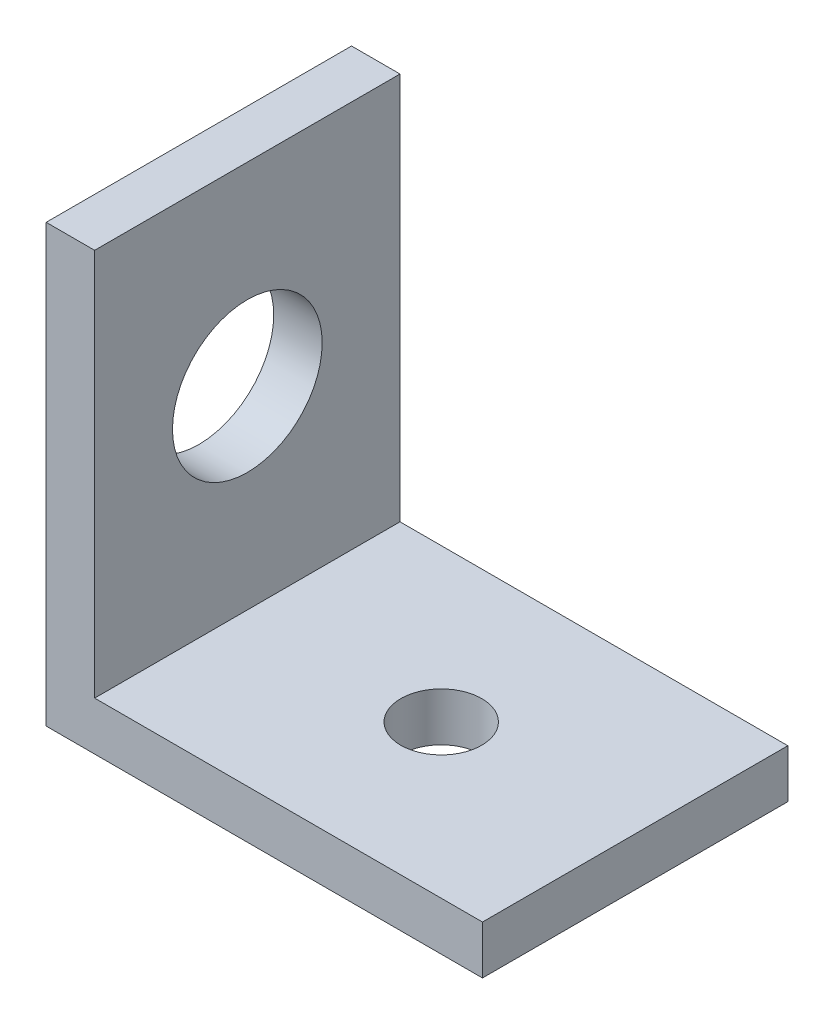
ISO-10303-21;
HEADER;
FILE_DESCRIPTION(('STEP AP214'),'2;1');
FILE_NAME('part.step','',(''),(''),'','','');
FILE_SCHEMA(('AUTOMOTIVE_DESIGN { 1 0 10303 214 1 1 1 1 }'));
ENDSEC;
DATA;
#1=APPLICATION_CONTEXT('core data for automotive mechanical design processes');
#2=APPLICATION_PROTOCOL_DEFINITION('international standard','automotive_design',2000,#1);
#3=PRODUCT_CONTEXT('',#1,'mechanical');
#4=PRODUCT('Part','Part','',(#3));
#5=PRODUCT_RELATED_PRODUCT_CATEGORY('part','',(#4));
#6=PRODUCT_DEFINITION_FORMATION('','',#4);
#7=PRODUCT_DEFINITION_CONTEXT('part definition',#1,'design');
#8=PRODUCT_DEFINITION('design','',#6,#7);
#9=PRODUCT_DEFINITION_SHAPE('','',#8);
#10=(LENGTH_UNIT() NAMED_UNIT(*) SI_UNIT(.MILLI.,.METRE.));
#11=(NAMED_UNIT(*) PLANE_ANGLE_UNIT() SI_UNIT($,.RADIAN.));
#12=(NAMED_UNIT(*) SI_UNIT($,.STERADIAN.) SOLID_ANGLE_UNIT());
#13=UNCERTAINTY_MEASURE_WITH_UNIT(LENGTH_MEASURE(1.E-05),#10,'distance_accuracy_value','');
#14=(GEOMETRIC_REPRESENTATION_CONTEXT(3) GLOBAL_UNCERTAINTY_ASSIGNED_CONTEXT((#13)) GLOBAL_UNIT_ASSIGNED_CONTEXT((#10,
#11,#12)) REPRESENTATION_CONTEXT('',''));
#15=CARTESIAN_POINT('',(0.,0.,0.));
#16=DIRECTION('',(0.,0.,1.));
#17=DIRECTION('',(1.,0.,0.));
#18=AXIS2_PLACEMENT_3D('',#15,#16,#17);
#19=CARTESIAN_POINT('',(-3.175,12.7,10.));
#20=DIRECTION('',(-1.,0.,0.));
#21=DIRECTION('',(0.,0.,1.));
#22=AXIS2_PLACEMENT_3D('',#19,#20,#21);
#23=CYLINDRICAL_SURFACE('',#22,4.9022);
#24=CARTESIAN_POINT('',(0.,12.7,10.));
#25=DIRECTION('',(-1.,0.,0.));
#26=DIRECTION('',(0.,-1.,0.));
#27=AXIS2_PLACEMENT_3D('',#24,#25,#26);
#28=CIRCLE('',#27,4.9022);
#29=CARTESIAN_POINT('',(0.,7.79780000000001,10.));
#30=VERTEX_POINT('',#29);
#31=EDGE_CURVE('E150',#30,#30,#28,.T.);
#32=ORIENTED_EDGE('',*,*,#31,.F.);
#33=EDGE_LOOP('',(#32));
#34=FACE_BOUND('',#33,.T.);
#35=CARTESIAN_POINT('',(-3.174,12.7,10.));
#36=DIRECTION('',(-1.,0.,0.));
#37=DIRECTION('',(0.,-1.,0.));
#38=AXIS2_PLACEMENT_3D('',#35,#36,#37);
#39=CIRCLE('',#38,4.9022);
#40=CARTESIAN_POINT('',(-3.174,7.79780000000001,10.));
#41=VERTEX_POINT('',#40);
#42=EDGE_CURVE('E50',#41,#41,#39,.F.);
#43=ORIENTED_EDGE('',*,*,#42,.F.);
#44=EDGE_LOOP('',(#43));
#45=FACE_BOUND('',#44,.T.);
#46=ADVANCED_FACE('F46',(#34,#45),#23,.F.);
#47=CARTESIAN_POINT('',(0.,2.54000000000002,20.));
#48=DIRECTION('',(-1.,0.,0.));
#49=DIRECTION('',(0.,-1.,0.));
#50=AXIS2_PLACEMENT_3D('',#47,#48,#49);
#51=PLANE('',#50);
#52=ORIENTED_EDGE('',*,*,#31,.T.);
#53=EDGE_LOOP('',(#52));
#54=FACE_BOUND('',#53,.T.);
#55=DIRECTION('',(0.,1.,0.));
#56=VECTOR('',#55,1.);
#57=CARTESIAN_POINT('',(0.,2.54000000000002,0.));
#58=LINE('',#57,#56);
#59=CARTESIAN_POINT('',(0.,0.,0.));
#60=VERTEX_POINT('',#59);
#61=CARTESIAN_POINT('',(0.,25.4,0.));
#62=VERTEX_POINT('',#61);
#63=EDGE_CURVE('E95',#60,#62,#58,.T.);
#64=ORIENTED_EDGE('',*,*,#63,.T.);
#65=DIRECTION('',(0.,0.,-1.));
#66=VECTOR('',#65,1.);
#67=CARTESIAN_POINT('',(0.,25.4,20.));
#68=LINE('',#67,#66);
#69=CARTESIAN_POINT('',(0.,25.4,20.));
#70=VERTEX_POINT('',#69);
#71=EDGE_CURVE('E12',#70,#62,#68,.T.);
#72=ORIENTED_EDGE('',*,*,#71,.F.);
#73=DIRECTION('',(0.,-1.,0.));
#74=VECTOR('',#73,1.);
#75=CARTESIAN_POINT('',(0.,2.54000000000002,20.));
#76=LINE('',#75,#74);
#77=CARTESIAN_POINT('',(0.,0.,20.));
#78=VERTEX_POINT('',#77);
#79=EDGE_CURVE('E66',#70,#78,#76,.T.);
#80=ORIENTED_EDGE('',*,*,#79,.T.);
#81=DIRECTION('',(0.,0.,-1.));
#82=VECTOR('',#81,1.);
#83=CARTESIAN_POINT('',(0.,0.,20.));
#84=LINE('',#83,#82);
#85=EDGE_CURVE('E101',#78,#60,#84,.T.);
#86=ORIENTED_EDGE('',*,*,#85,.T.);
#87=EDGE_LOOP('',(#64,#72,#80,#86));
#88=FACE_BOUND('',#87,.T.);
#89=ADVANCED_FACE('F170',(#54,#88),#51,.F.);
#90=CARTESIAN_POINT('',(0.,25.4,20.));
#91=DIRECTION('',(0.,-1.,0.));
#92=DIRECTION('',(0.,0.,-1.));
#93=AXIS2_PLACEMENT_3D('',#90,#91,#92);
#94=PLANE('',#93);
#95=DIRECTION('',(-1.,0.,0.));
#96=VECTOR('',#95,1.);
#97=CARTESIAN_POINT('',(0.,25.4,0.));
#98=LINE('',#97,#96);
#99=CARTESIAN_POINT('',(-3.175,25.4,0.));
#100=VERTEX_POINT('',#99);
#101=EDGE_CURVE('E88',#62,#100,#98,.T.);
#102=ORIENTED_EDGE('',*,*,#101,.T.);
#103=DIRECTION('',(0.,0.,-1.));
#104=VECTOR('',#103,1.);
#105=CARTESIAN_POINT('',(-3.175,25.4,20.));
#106=LINE('',#105,#104);
#107=CARTESIAN_POINT('',(-3.175,25.4,20.));
#108=VERTEX_POINT('',#107);
#109=EDGE_CURVE('E57',#108,#100,#106,.T.);
#110=ORIENTED_EDGE('',*,*,#109,.F.);
#111=DIRECTION('',(-1.,0.,0.));
#112=VECTOR('',#111,1.);
#113=CARTESIAN_POINT('',(0.,25.4,20.));
#114=LINE('',#113,#112);
#115=EDGE_CURVE('E116',#70,#108,#114,.T.);
#116=ORIENTED_EDGE('',*,*,#115,.F.);
#117=ORIENTED_EDGE('',*,*,#71,.T.);
#118=EDGE_LOOP('',(#102,#110,#116,#117));
#119=FACE_BOUND('',#118,.T.);
#120=ADVANCED_FACE('F207',(#119),#94,.F.);
#121=CARTESIAN_POINT('',(-3.175,25.4,20.));
#122=DIRECTION('',(1.,0.,0.));
#123=DIRECTION('',(0.,1.,0.));
#124=AXIS2_PLACEMENT_3D('',#121,#122,#123);
#125=PLANE('',#124);
#126=CARTESIAN_POINT('',(-3.175,12.7,10.));
#127=DIRECTION('',(-1.,0.,0.));
#128=DIRECTION('',(0.,-1.,0.));
#129=AXIS2_PLACEMENT_3D('',#126,#127,#128);
#130=CIRCLE('',#129,9.525);
#131=CARTESIAN_POINT('',(-3.175,3.175,10.));
#132=VERTEX_POINT('',#131);
#133=EDGE_CURVE('E186',#132,#132,#130,.T.);
#134=ORIENTED_EDGE('',*,*,#133,.F.);
#135=EDGE_LOOP('',(#134));
#136=FACE_BOUND('',#135,.T.);
#137=DIRECTION('',(0.,-1.,0.));
#138=VECTOR('',#137,1.);
#139=CARTESIAN_POINT('',(-3.175,25.4,0.));
#140=LINE('',#139,#138);
#141=CARTESIAN_POINT('',(-3.175,-3.175,0.));
#142=VERTEX_POINT('',#141);
#143=EDGE_CURVE('E124',#100,#142,#140,.T.);
#144=ORIENTED_EDGE('',*,*,#143,.T.);
#145=DIRECTION('',(0.,0.,-1.));
#146=VECTOR('',#145,1.);
#147=CARTESIAN_POINT('',(-3.175,-3.175,20.));
#148=LINE('',#147,#146);
#149=CARTESIAN_POINT('',(-3.175,-3.175,20.));
#150=VERTEX_POINT('',#149);
#151=EDGE_CURVE('E121',#150,#142,#148,.T.);
#152=ORIENTED_EDGE('',*,*,#151,.F.);
#153=DIRECTION('',(0.,-1.,0.));
#154=VECTOR('',#153,1.);
#155=CARTESIAN_POINT('',(-3.175,25.4,20.));
#156=LINE('',#155,#154);
#157=EDGE_CURVE('E108',#108,#150,#156,.T.);
#158=ORIENTED_EDGE('',*,*,#157,.F.);
#159=ORIENTED_EDGE('',*,*,#109,.T.);
#160=EDGE_LOOP('',(#144,#152,#158,#159));
#161=FACE_BOUND('',#160,.T.);
#162=ADVANCED_FACE('F122',(#136,#161),#125,.F.);
#163=CARTESIAN_POINT('',(-3.175,-3.175,20.));
#164=DIRECTION('',(0.,1.,0.));
#165=DIRECTION('',(-1.,0.,0.));
#166=AXIS2_PLACEMENT_3D('',#163,#164,#165);
#167=PLANE('',#166);
#168=CARTESIAN_POINT('',(12.7,-3.175,10.));
#169=DIRECTION('',(0.,1.,0.));
#170=DIRECTION('',(0.,0.,1.));
#171=AXIS2_PLACEMENT_3D('',#168,#169,#170);
#172=CIRCLE('',#171,2.65);
#173=CARTESIAN_POINT('',(12.7,-3.175,12.65));
#174=VERTEX_POINT('',#173);
#175=EDGE_CURVE('E178',#174,#174,#172,.T.);
#176=ORIENTED_EDGE('',*,*,#175,.T.);
#177=EDGE_LOOP('',(#176));
#178=FACE_BOUND('',#177,.T.);
#179=DIRECTION('',(1.,0.,0.));
#180=VECTOR('',#179,1.);
#181=CARTESIAN_POINT('',(-3.175,-3.175,0.));
#182=LINE('',#181,#180);
#183=CARTESIAN_POINT('',(25.4,-3.175,0.));
#184=VERTEX_POINT('',#183);
#185=EDGE_CURVE('E153',#142,#184,#182,.T.);
#186=ORIENTED_EDGE('',*,*,#185,.T.);
#187=DIRECTION('',(0.,0.,-1.));
#188=VECTOR('',#187,1.);
#189=CARTESIAN_POINT('',(25.4,-3.175,20.));
#190=LINE('',#189,#188);
#191=CARTESIAN_POINT('',(25.4,-3.175,20.));
#192=VERTEX_POINT('',#191);
#193=EDGE_CURVE('E128',#192,#184,#190,.T.);
#194=ORIENTED_EDGE('',*,*,#193,.F.);
#195=DIRECTION('',(1.,0.,0.));
#196=VECTOR('',#195,1.);
#197=CARTESIAN_POINT('',(-3.175,-3.175,20.));
#198=LINE('',#197,#196);
#199=EDGE_CURVE('E113',#150,#192,#198,.T.);
#200=ORIENTED_EDGE('',*,*,#199,.F.);
#201=ORIENTED_EDGE('',*,*,#151,.T.);
#202=EDGE_LOOP('',(#186,#194,#200,#201));
#203=FACE_BOUND('',#202,.T.);
#204=ADVANCED_FACE('F130',(#178,#203),#167,.F.);
#205=CARTESIAN_POINT('',(25.4,-3.175,20.));
#206=DIRECTION('',(-1.,0.,0.));
#207=DIRECTION('',(0.,0.,1.));
#208=AXIS2_PLACEMENT_3D('',#205,#206,#207);
#209=PLANE('',#208);
#210=DIRECTION('',(0.,1.,0.));
#211=VECTOR('',#210,1.);
#212=CARTESIAN_POINT('',(25.4,-3.175,0.));
#213=LINE('',#212,#211);
#214=CARTESIAN_POINT('',(25.4,0.,0.));
#215=VERTEX_POINT('',#214);
#216=EDGE_CURVE('E149',#184,#215,#213,.T.);
#217=ORIENTED_EDGE('',*,*,#216,.T.);
#218=DIRECTION('',(0.,0.,-1.));
#219=VECTOR('',#218,1.);
#220=CARTESIAN_POINT('',(25.4,0.,20.));
#221=LINE('',#220,#219);
#222=CARTESIAN_POINT('',(25.4,0.,20.));
#223=VERTEX_POINT('',#222);
#224=EDGE_CURVE('E166',#223,#215,#221,.T.);
#225=ORIENTED_EDGE('',*,*,#224,.F.);
#226=DIRECTION('',(0.,1.,0.));
#227=VECTOR('',#226,1.);
#228=CARTESIAN_POINT('',(25.4,-3.175,20.));
#229=LINE('',#228,#227);
#230=EDGE_CURVE('E134',#192,#223,#229,.T.);
#231=ORIENTED_EDGE('',*,*,#230,.F.);
#232=ORIENTED_EDGE('',*,*,#193,.T.);
#233=EDGE_LOOP('',(#217,#225,#231,#232));
#234=FACE_BOUND('',#233,.T.);
#235=ADVANCED_FACE('F227',(#234),#209,.F.);
#236=CARTESIAN_POINT('',(25.4,0.,20.));
#237=DIRECTION('',(0.,-1.,0.));
#238=DIRECTION('',(1.,0.,0.));
#239=AXIS2_PLACEMENT_3D('',#236,#237,#238);
#240=PLANE('',#239);
#241=CARTESIAN_POINT('',(12.7,0.,10.));
#242=DIRECTION('',(0.,1.,0.));
#243=DIRECTION('',(0.,0.,1.));
#244=AXIS2_PLACEMENT_3D('',#241,#242,#243);
#245=CIRCLE('',#244,2.65);
#246=CARTESIAN_POINT('',(12.7,0.,12.65));
#247=VERTEX_POINT('',#246);
#248=EDGE_CURVE('E182',#247,#247,#245,.T.);
#249=ORIENTED_EDGE('',*,*,#248,.F.);
#250=EDGE_LOOP('',(#249));
#251=FACE_BOUND('',#250,.T.);
#252=DIRECTION('',(-1.,0.,0.));
#253=VECTOR('',#252,1.);
#254=CARTESIAN_POINT('',(25.4,0.,0.));
#255=LINE('',#254,#253);
#256=EDGE_CURVE('E146',#215,#60,#255,.T.);
#257=ORIENTED_EDGE('',*,*,#256,.T.);
#258=ORIENTED_EDGE('',*,*,#85,.F.);
#259=DIRECTION('',(1.,0.,0.));
#260=VECTOR('',#259,1.);
#261=CARTESIAN_POINT('',(0.,0.,20.));
#262=LINE('',#261,#260);
#263=EDGE_CURVE('E137',#78,#223,#262,.T.);
#264=ORIENTED_EDGE('',*,*,#263,.T.);
#265=ORIENTED_EDGE('',*,*,#224,.T.);
#266=EDGE_LOOP('',(#257,#258,#264,#265));
#267=FACE_BOUND('',#266,.T.);
#268=ADVANCED_FACE('F48',(#251,#267),#240,.F.);
#269=CARTESIAN_POINT('',(0.,0.,20.));
#270=DIRECTION('',(0.,0.,1.));
#271=DIRECTION('',(1.,0.,0.));
#272=AXIS2_PLACEMENT_3D('',#269,#270,#271);
#273=PLANE('',#272);
#274=ORIENTED_EDGE('',*,*,#79,.F.);
#275=ORIENTED_EDGE('',*,*,#115,.T.);
#276=ORIENTED_EDGE('',*,*,#157,.T.);
#277=ORIENTED_EDGE('',*,*,#199,.T.);
#278=ORIENTED_EDGE('',*,*,#230,.T.);
#279=ORIENTED_EDGE('',*,*,#263,.F.);
#280=EDGE_LOOP('',(#274,#275,#276,#277,#278,#279));
#281=FACE_BOUND('',#280,.T.);
#282=ADVANCED_FACE('F110',(#281),#273,.T.);
#283=CARTESIAN_POINT('',(0.,0.,0.));
#284=DIRECTION('',(0.,0.,1.));
#285=DIRECTION('',(1.,0.,0.));
#286=AXIS2_PLACEMENT_3D('',#283,#284,#285);
#287=PLANE('',#286);
#288=ORIENTED_EDGE('',*,*,#63,.F.);
#289=ORIENTED_EDGE('',*,*,#256,.F.);
#290=ORIENTED_EDGE('',*,*,#216,.F.);
#291=ORIENTED_EDGE('',*,*,#185,.F.);
#292=ORIENTED_EDGE('',*,*,#143,.F.);
#293=ORIENTED_EDGE('',*,*,#101,.F.);
#294=EDGE_LOOP('',(#288,#289,#290,#291,#292,#293));
#295=FACE_BOUND('',#294,.T.);
#296=ADVANCED_FACE('F217',(#295),#287,.F.);
#297=CARTESIAN_POINT('',(12.7,0.,10.));
#298=DIRECTION('',(0.,1.,0.));
#299=DIRECTION('',(0.,0.,1.));
#300=AXIS2_PLACEMENT_3D('',#297,#298,#299);
#301=CYLINDRICAL_SURFACE('',#300,2.65);
#302=ORIENTED_EDGE('',*,*,#175,.F.);
#303=EDGE_LOOP('',(#302));
#304=FACE_BOUND('',#303,.T.);
#305=ORIENTED_EDGE('',*,*,#248,.T.);
#306=EDGE_LOOP('',(#305));
#307=FACE_BOUND('',#306,.T.);
#308=ADVANCED_FACE('F213',(#304,#307),#301,.F.);
#309=CARTESIAN_POINT('',(-3.174,12.7,10.));
#310=DIRECTION('',(-1.,0.,0.));
#311=DIRECTION('',(0.,-1.,0.));
#312=AXIS2_PLACEMENT_3D('',#309,#310,#311);
#313=PLANE('',#312);
#314=CARTESIAN_POINT('',(-3.174,12.7,10.));
#315=DIRECTION('',(-1.,0.,0.));
#316=DIRECTION('',(0.,-1.,0.));
#317=AXIS2_PLACEMENT_3D('',#314,#315,#316);
#318=CIRCLE('',#317,9.525);
#319=CARTESIAN_POINT('',(-3.174,3.175,10.));
#320=VERTEX_POINT('',#319);
#321=EDGE_CURVE('E190',#320,#320,#318,.T.);
#322=ORIENTED_EDGE('',*,*,#321,.T.);
#323=EDGE_LOOP('',(#322));
#324=FACE_BOUND('',#323,.T.);
#325=ORIENTED_EDGE('',*,*,#42,.T.);
#326=EDGE_LOOP('',(#325));
#327=FACE_BOUND('',#326,.T.);
#328=ADVANCED_FACE('F199',(#324,#327),#313,.T.);
#329=CARTESIAN_POINT('',(-3.174,12.7,10.));
#330=DIRECTION('',(-1.,0.,0.));
#331=DIRECTION('',(0.,-1.,0.));
#332=AXIS2_PLACEMENT_3D('',#329,#330,#331);
#333=CYLINDRICAL_SURFACE('',#332,9.525);
#334=ORIENTED_EDGE('',*,*,#321,.F.);
#335=EDGE_LOOP('',(#334));
#336=FACE_BOUND('',#335,.T.);
#337=ORIENTED_EDGE('',*,*,#133,.T.);
#338=EDGE_LOOP('',(#337));
#339=FACE_BOUND('',#338,.T.);
#340=ADVANCED_FACE('F247',(#336,#339),#333,.F.);
#341=CLOSED_SHELL('',(#46,#89,#120,#162,#204,#235,#268,#282,#296,#308,#328,#340));
#342=MANIFOLD_SOLID_BREP('B2',#341);
#343=ADVANCED_BREP_SHAPE_REPRESENTATION('',(#18,#342),#14);
#344=SHAPE_DEFINITION_REPRESENTATION(#9,#343);
ENDSEC;
END-ISO-10303-21;
